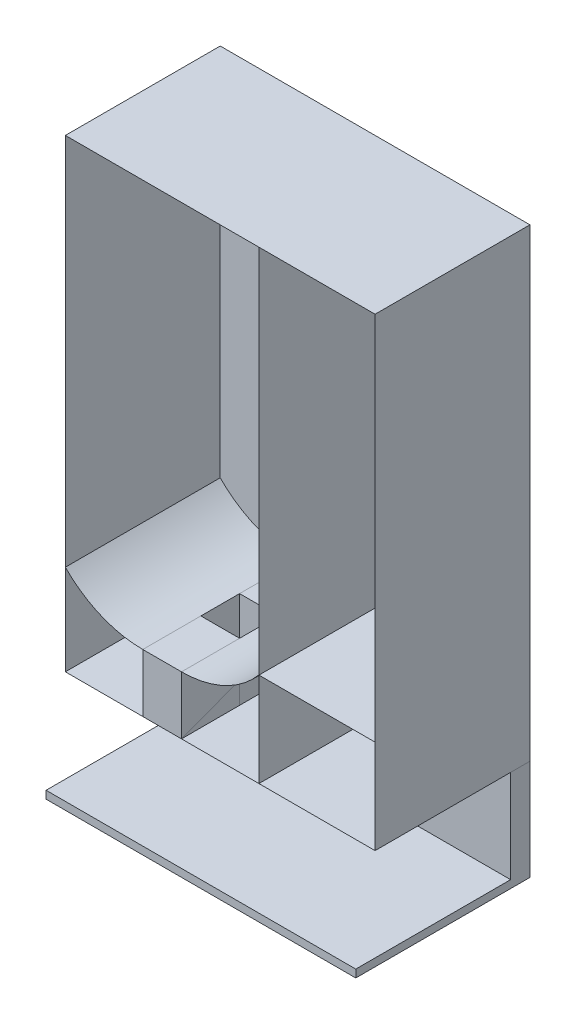
ISO-10303-21;
HEADER;
FILE_DESCRIPTION(('STEP AP214'),'2;1');
FILE_NAME('part.step','',(''),(''),'','','');
FILE_SCHEMA(('AUTOMOTIVE_DESIGN { 1 0 10303 214 1 1 1 1 }'));
ENDSEC;
DATA;
#1=APPLICATION_CONTEXT('core data for automotive mechanical design processes');
#2=APPLICATION_PROTOCOL_DEFINITION('international standard','automotive_design',2000,#1);
#3=PRODUCT_CONTEXT('',#1,'mechanical');
#4=PRODUCT('Part','Part','',(#3));
#5=PRODUCT_RELATED_PRODUCT_CATEGORY('part','',(#4));
#6=PRODUCT_DEFINITION_FORMATION('','',#4);
#7=PRODUCT_DEFINITION_CONTEXT('part definition',#1,'design');
#8=PRODUCT_DEFINITION('design','',#6,#7);
#9=PRODUCT_DEFINITION_SHAPE('','',#8);
#10=(LENGTH_UNIT() NAMED_UNIT(*) SI_UNIT(.MILLI.,.METRE.));
#11=(NAMED_UNIT(*) PLANE_ANGLE_UNIT() SI_UNIT($,.RADIAN.));
#12=(NAMED_UNIT(*) SI_UNIT($,.STERADIAN.) SOLID_ANGLE_UNIT());
#13=UNCERTAINTY_MEASURE_WITH_UNIT(LENGTH_MEASURE(1.E-05),#10,'distance_accuracy_value','');
#14=(GEOMETRIC_REPRESENTATION_CONTEXT(3) GLOBAL_UNCERTAINTY_ASSIGNED_CONTEXT((#13)) GLOBAL_UNIT_ASSIGNED_CONTEXT((#10,
#11,#12)) REPRESENTATION_CONTEXT('',''));
#15=CARTESIAN_POINT('',(0.,0.,0.));
#16=DIRECTION('',(0.,0.,1.));
#17=DIRECTION('',(1.,0.,0.));
#18=AXIS2_PLACEMENT_3D('',#15,#16,#17);
#19=CARTESIAN_POINT('',(49.9253219119787,-178.659775416633,0.));
#20=DIRECTION('',(0.,-1.,0.));
#21=DIRECTION('',(0.,0.,-1.));
#22=AXIS2_PLACEMENT_3D('',#19,#20,#21);
#23=PLANE('',#22);
#24=DIRECTION('',(1.,0.,0.));
#25=VECTOR('',#24,1.);
#26=CARTESIAN_POINT('',(49.9253219119787,-178.659775416633,200.));
#27=LINE('',#26,#25);
#28=CARTESIAN_POINT('',(49.9253219119787,-178.659775416633,200.));
#29=VERTEX_POINT('',#28);
#30=CARTESIAN_POINT('',(200.,-178.659775416633,200.));
#31=VERTEX_POINT('',#30);
#32=EDGE_CURVE('E72',#29,#31,#27,.T.);
#33=ORIENTED_EDGE('',*,*,#32,.F.);
#34=DIRECTION('',(0.,0.,1.));
#35=VECTOR('',#34,1.);
#36=CARTESIAN_POINT('',(49.9253219119787,-178.659775416633,0.));
#37=LINE('',#36,#35);
#38=CARTESIAN_POINT('',(49.9253219119787,-178.659775416633,0.));
#39=VERTEX_POINT('',#38);
#40=EDGE_CURVE('E54',#39,#29,#37,.T.);
#41=ORIENTED_EDGE('',*,*,#40,.F.);
#42=DIRECTION('',(1.,0.,0.));
#43=VECTOR('',#42,1.);
#44=CARTESIAN_POINT('',(49.9253219119787,-178.659775416633,0.));
#45=LINE('',#44,#43);
#46=CARTESIAN_POINT('',(200.,-178.659775416633,0.));
#47=VERTEX_POINT('',#46);
#48=EDGE_CURVE('E60',#39,#47,#45,.T.);
#49=ORIENTED_EDGE('',*,*,#48,.T.);
#50=DIRECTION('',(0.,0.,1.));
#51=VECTOR('',#50,1.);
#52=CARTESIAN_POINT('',(200.,-178.659775416633,0.));
#53=LINE('',#52,#51);
#54=EDGE_CURVE('E12',#47,#31,#53,.T.);
#55=ORIENTED_EDGE('',*,*,#54,.T.);
#56=EDGE_LOOP('',(#33,#41,#49,#55));
#57=FACE_BOUND('',#56,.T.);
#58=ADVANCED_FACE('F53',(#57),#23,.T.);
#59=OPEN_SHELL('',(#58));
#60=SHELL_BASED_SURFACE_MODEL('B2',(#59));
#61=CARTESIAN_POINT('',(-100.,-225.,200.));
#62=DIRECTION('',(1.,0.,0.));
#63=DIRECTION('',(0.,0.,-1.));
#64=AXIS2_PLACEMENT_3D('',#61,#62,#63);
#65=PLANE('',#64);
#66=DIRECTION('',(0.,0.,1.));
#67=VECTOR('',#66,1.);
#68=CARTESIAN_POINT('',(-100.,-300.,200.));
#69=LINE('',#68,#67);
#70=CARTESIAN_POINT('',(-100.,-300.,125.));
#71=VERTEX_POINT('',#70);
#72=CARTESIAN_POINT('',(-100.,-300.,200.));
#73=VERTEX_POINT('',#72);
#74=EDGE_CURVE('E169',#71,#73,#69,.T.);
#75=ORIENTED_EDGE('',*,*,#74,.T.);
#76=DIRECTION('',(0.,-1.,0.));
#77=VECTOR('',#76,1.);
#78=CARTESIAN_POINT('',(-100.,-225.,200.));
#79=LINE('',#78,#77);
#80=CARTESIAN_POINT('',(-100.,-225.,200.));
#81=VERTEX_POINT('',#80);
#82=EDGE_CURVE('E51',#81,#73,#79,.T.);
#83=ORIENTED_EDGE('',*,*,#82,.F.);
#84=DIRECTION('',(0.,0.,1.));
#85=VECTOR('',#84,1.);
#86=CARTESIAN_POINT('',(-100.,-225.,200.));
#87=LINE('',#86,#85);
#88=CARTESIAN_POINT('',(-100.,-225.,125.));
#89=VERTEX_POINT('',#88);
#90=EDGE_CURVE('E157',#89,#81,#87,.T.);
#91=ORIENTED_EDGE('',*,*,#90,.F.);
#92=DIRECTION('',(0.,-1.,0.));
#93=VECTOR('',#92,1.);
#94=CARTESIAN_POINT('',(-100.,-225.,125.));
#95=LINE('',#94,#93);
#96=EDGE_CURVE('E165',#89,#71,#95,.T.);
#97=ORIENTED_EDGE('',*,*,#96,.T.);
#98=EDGE_LOOP('',(#75,#83,#91,#97));
#99=FACE_BOUND('',#98,.T.);
#100=ADVANCED_FACE('F106',(#99),#65,.F.);
#101=CARTESIAN_POINT('',(-50.,-225.,200.));
#102=DIRECTION('',(0.,0.,-1.));
#103=DIRECTION('',(-1.,0.,0.));
#104=AXIS2_PLACEMENT_3D('',#101,#102,#103);
#105=PLANE('',#104);
#106=DIRECTION('',(1.,0.,0.));
#107=VECTOR('',#106,1.);
#108=CARTESIAN_POINT('',(-50.,-300.,200.));
#109=LINE('',#108,#107);
#110=CARTESIAN_POINT('',(-50.,-300.,200.));
#111=VERTEX_POINT('',#110);
#112=EDGE_CURVE('E161',#73,#111,#109,.T.);
#113=ORIENTED_EDGE('',*,*,#112,.T.);
#114=DIRECTION('',(0.,-1.,0.));
#115=VECTOR('',#114,1.);
#116=CARTESIAN_POINT('',(-50.,-225.,200.));
#117=LINE('',#116,#115);
#118=CARTESIAN_POINT('',(-50.,-225.,200.));
#119=VERTEX_POINT('',#118);
#120=EDGE_CURVE('E114',#119,#111,#117,.T.);
#121=ORIENTED_EDGE('',*,*,#120,.F.);
#122=DIRECTION('',(1.,0.,0.));
#123=VECTOR('',#122,1.);
#124=CARTESIAN_POINT('',(-50.,-225.,200.));
#125=LINE('',#124,#123);
#126=EDGE_CURVE('E152',#81,#119,#125,.T.);
#127=ORIENTED_EDGE('',*,*,#126,.F.);
#128=ORIENTED_EDGE('',*,*,#82,.T.);
#129=EDGE_LOOP('',(#113,#121,#127,#128));
#130=FACE_BOUND('',#129,.T.);
#131=ADVANCED_FACE('F160',(#130),#105,.F.);
#132=CARTESIAN_POINT('',(-50.,-225.,125.));
#133=DIRECTION('',(-1.,0.,0.));
#134=DIRECTION('',(0.,0.,1.));
#135=AXIS2_PLACEMENT_3D('',#132,#133,#134);
#136=PLANE('',#135);
#137=DIRECTION('',(0.,0.,-1.));
#138=VECTOR('',#137,1.);
#139=CARTESIAN_POINT('',(-50.,-300.,125.));
#140=LINE('',#139,#138);
#141=CARTESIAN_POINT('',(-50.,-300.,125.));
#142=VERTEX_POINT('',#141);
#143=EDGE_CURVE('E139',#111,#142,#140,.T.);
#144=ORIENTED_EDGE('',*,*,#143,.T.);
#145=DIRECTION('',(0.,-1.,0.));
#146=VECTOR('',#145,1.);
#147=CARTESIAN_POINT('',(-50.,-225.,125.));
#148=LINE('',#147,#146);
#149=CARTESIAN_POINT('',(-50.,-225.,125.));
#150=VERTEX_POINT('',#149);
#151=EDGE_CURVE('E162',#150,#142,#148,.T.);
#152=ORIENTED_EDGE('',*,*,#151,.F.);
#153=DIRECTION('',(0.,0.,-1.));
#154=VECTOR('',#153,1.);
#155=CARTESIAN_POINT('',(-50.,-225.,125.));
#156=LINE('',#155,#154);
#157=EDGE_CURVE('E155',#119,#150,#156,.T.);
#158=ORIENTED_EDGE('',*,*,#157,.F.);
#159=ORIENTED_EDGE('',*,*,#120,.T.);
#160=EDGE_LOOP('',(#144,#152,#158,#159));
#161=FACE_BOUND('',#160,.T.);
#162=ADVANCED_FACE('F163',(#161),#136,.F.);
#163=CARTESIAN_POINT('',(-100.,-225.,125.));
#164=DIRECTION('',(0.,0.,1.));
#165=DIRECTION('',(1.,0.,0.));
#166=AXIS2_PLACEMENT_3D('',#163,#164,#165);
#167=PLANE('',#166);
#168=DIRECTION('',(-1.,0.,0.));
#169=VECTOR('',#168,1.);
#170=CARTESIAN_POINT('',(-100.,-300.,125.));
#171=LINE('',#170,#169);
#172=EDGE_CURVE('E145',#142,#71,#171,.T.);
#173=ORIENTED_EDGE('',*,*,#172,.T.);
#174=ORIENTED_EDGE('',*,*,#96,.F.);
#175=DIRECTION('',(-1.,0.,0.));
#176=VECTOR('',#175,1.);
#177=CARTESIAN_POINT('',(-100.,-225.,125.));
#178=LINE('',#177,#176);
#179=EDGE_CURVE('E122',#150,#89,#178,.T.);
#180=ORIENTED_EDGE('',*,*,#179,.F.);
#181=ORIENTED_EDGE('',*,*,#151,.T.);
#182=EDGE_LOOP('',(#173,#174,#180,#181));
#183=FACE_BOUND('',#182,.T.);
#184=ADVANCED_FACE('F176',(#183),#167,.F.);
#185=CARTESIAN_POINT('',(0.,-225.,0.));
#186=DIRECTION('',(0.,-1.,0.));
#187=DIRECTION('',(0.,0.,-1.));
#188=AXIS2_PLACEMENT_3D('',#185,#186,#187);
#189=PLANE('',#188);
#190=ORIENTED_EDGE('',*,*,#90,.T.);
#191=ORIENTED_EDGE('',*,*,#126,.T.);
#192=ORIENTED_EDGE('',*,*,#157,.T.);
#193=ORIENTED_EDGE('',*,*,#179,.T.);
#194=EDGE_LOOP('',(#190,#191,#192,#193));
#195=FACE_BOUND('',#194,.T.);
#196=ADVANCED_FACE('F153',(#195),#189,.F.);
#197=CARTESIAN_POINT('',(0.,-300.,0.));
#198=DIRECTION('',(0.,-1.,0.));
#199=DIRECTION('',(0.,0.,-1.));
#200=AXIS2_PLACEMENT_3D('',#197,#198,#199);
#201=PLANE('',#200);
#202=ORIENTED_EDGE('',*,*,#74,.F.);
#203=ORIENTED_EDGE('',*,*,#172,.F.);
#204=ORIENTED_EDGE('',*,*,#143,.F.);
#205=ORIENTED_EDGE('',*,*,#112,.F.);
#206=EDGE_LOOP('',(#202,#203,#204,#205));
#207=FACE_BOUND('',#206,.T.);
#208=ADVANCED_FACE('F179',(#207),#201,.T.);
#209=CLOSED_SHELL('',(#100,#131,#162,#184,#196,#208));
#210=MANIFOLD_SOLID_BREP('B6',#209);
#211=CARTESIAN_POINT('',(-50.,-300.,0.));
#212=DIRECTION('',(0.,1.,0.));
#213=DIRECTION('',(0.,0.,1.));
#214=AXIS2_PLACEMENT_3D('',#211,#212,#213);
#215=PLANE('',#214);
#216=DIRECTION('',(-1.,0.,0.));
#217=VECTOR('',#216,1.);
#218=CARTESIAN_POINT('',(-50.,-300.,200.));
#219=LINE('',#218,#217);
#220=CARTESIAN_POINT('',(-50.,-300.,200.));
#221=VERTEX_POINT('',#220);
#222=CARTESIAN_POINT('',(-100.,-300.,200.));
#223=VERTEX_POINT('',#222);
#224=EDGE_CURVE('E288',#221,#223,#219,.T.);
#225=ORIENTED_EDGE('',*,*,#224,.F.);
#226=DIRECTION('',(0.,0.,1.));
#227=VECTOR('',#226,1.);
#228=CARTESIAN_POINT('',(-50.,-300.,0.));
#229=LINE('',#228,#227);
#230=CARTESIAN_POINT('',(-50.,-300.,0.));
#231=VERTEX_POINT('',#230);
#232=EDGE_CURVE('E241',#231,#221,#229,.T.);
#233=ORIENTED_EDGE('',*,*,#232,.F.);
#234=DIRECTION('',(-1.,0.,0.));
#235=VECTOR('',#234,1.);
#236=CARTESIAN_POINT('',(-50.,-300.,0.));
#237=LINE('',#236,#235);
#238=CARTESIAN_POINT('',(-100.,-300.,0.));
#239=VERTEX_POINT('',#238);
#240=EDGE_CURVE('E104',#231,#239,#237,.T.);
#241=ORIENTED_EDGE('',*,*,#240,.T.);
#242=DIRECTION('',(0.,0.,1.));
#243=VECTOR('',#242,1.);
#244=CARTESIAN_POINT('',(-100.,-300.,0.));
#245=LINE('',#244,#243);
#246=EDGE_CURVE('E280',#239,#223,#245,.T.);
#247=ORIENTED_EDGE('',*,*,#246,.T.);
#248=EDGE_LOOP('',(#225,#233,#241,#247));
#249=FACE_BOUND('',#248,.T.);
#250=ADVANCED_FACE('F239',(#249),#215,.T.);
#251=CARTESIAN_POINT('',(-100.,-300.,0.));
#252=DIRECTION('',(1.,0.,0.));
#253=DIRECTION('',(0.,1.,0.));
#254=AXIS2_PLACEMENT_3D('',#251,#252,#253);
#255=PLANE('',#254);
#256=DIRECTION('',(0.,1.,0.));
#257=VECTOR('',#256,1.);
#258=CARTESIAN_POINT('',(-100.,-300.,200.));
#259=LINE('',#258,#257);
#260=CARTESIAN_POINT('',(-100.,-225.,200.));
#261=VERTEX_POINT('',#260);
#262=EDGE_CURVE('E285',#223,#261,#259,.T.);
#263=ORIENTED_EDGE('',*,*,#262,.F.);
#264=ORIENTED_EDGE('',*,*,#246,.F.);
#265=DIRECTION('',(0.,1.,0.));
#266=VECTOR('',#265,1.);
#267=CARTESIAN_POINT('',(-100.,-300.,0.));
#268=LINE('',#267,#266);
#269=CARTESIAN_POINT('',(-100.,-225.,0.));
#270=VERTEX_POINT('',#269);
#271=EDGE_CURVE('E283',#239,#270,#268,.T.);
#272=ORIENTED_EDGE('',*,*,#271,.T.);
#273=DIRECTION('',(0.,0.,1.));
#274=VECTOR('',#273,1.);
#275=CARTESIAN_POINT('',(-100.,-225.,0.));
#276=LINE('',#275,#274);
#277=EDGE_CURVE('E269',#270,#261,#276,.T.);
#278=ORIENTED_EDGE('',*,*,#277,.T.);
#279=EDGE_LOOP('',(#263,#264,#272,#278));
#280=FACE_BOUND('',#279,.T.);
#281=ADVANCED_FACE('F282',(#280),#255,.T.);
#282=CARTESIAN_POINT('',(-100.,-85.0094261131661,0.));
#283=DIRECTION('',(0.,0.,1.));
#284=DIRECTION('',(1.,0.,0.));
#285=AXIS2_PLACEMENT_3D('',#282,#283,#284);
#286=CYLINDRICAL_SURFACE('',#285,139.990573886834);
#287=CARTESIAN_POINT('',(-100.,-85.0094261131661,200.));
#288=DIRECTION('',(0.,0.,-1.));
#289=DIRECTION('',(-1.,0.,0.));
#290=AXIS2_PLACEMENT_3D('',#287,#288,#289);
#291=CIRCLE('',#290,139.990573886834);
#292=CARTESIAN_POINT('',(-200.,-182.975546671067,200.));
#293=VERTEX_POINT('',#292);
#294=EDGE_CURVE('E301',#261,#293,#291,.T.);
#295=ORIENTED_EDGE('',*,*,#294,.F.);
#296=ORIENTED_EDGE('',*,*,#277,.F.);
#297=CARTESIAN_POINT('',(-100.,-85.0094261131661,0.));
#298=DIRECTION('',(0.,0.,-1.));
#299=DIRECTION('',(-1.,0.,0.));
#300=AXIS2_PLACEMENT_3D('',#297,#298,#299);
#301=CIRCLE('',#300,139.990573886834);
#302=CARTESIAN_POINT('',(-200.,-182.975546671067,0.));
#303=VERTEX_POINT('',#302);
#304=EDGE_CURVE('E311',#270,#303,#301,.T.);
#305=ORIENTED_EDGE('',*,*,#304,.T.);
#306=DIRECTION('',(0.,0.,1.));
#307=VECTOR('',#306,1.);
#308=CARTESIAN_POINT('',(-200.,-182.975546671067,0.));
#309=LINE('',#308,#307);
#310=EDGE_CURVE('E252',#303,#293,#309,.T.);
#311=ORIENTED_EDGE('',*,*,#310,.T.);
#312=EDGE_LOOP('',(#295,#296,#305,#311));
#313=FACE_BOUND('',#312,.T.);
#314=ADVANCED_FACE('F294',(#313),#286,.F.);
#315=OPEN_SHELL('',(#250,#281,#314));
#316=SHELL_BASED_SURFACE_MODEL('B45',(#315));
#317=CARTESIAN_POINT('',(-50.,-300.,0.));
#318=DIRECTION('',(1.,0.,0.));
#319=DIRECTION('',(0.,1.,0.));
#320=AXIS2_PLACEMENT_3D('',#317,#318,#319);
#321=PLANE('',#320);
#322=DIRECTION('',(0.,1.,0.));
#323=VECTOR('',#322,1.);
#324=CARTESIAN_POINT('',(-50.,-300.,200.));
#325=LINE('',#324,#323);
#326=CARTESIAN_POINT('',(-50.,-300.,200.));
#327=VERTEX_POINT('',#326);
#328=CARTESIAN_POINT('',(-50.,-225.,200.));
#329=VERTEX_POINT('',#328);
#330=EDGE_CURVE('E389',#327,#329,#325,.T.);
#331=ORIENTED_EDGE('',*,*,#330,.F.);
#332=DIRECTION('',(0.,0.,1.));
#333=VECTOR('',#332,1.);
#334=CARTESIAN_POINT('',(-50.,-300.,0.));
#335=LINE('',#334,#333);
#336=CARTESIAN_POINT('',(-50.,-300.,0.));
#337=VERTEX_POINT('',#336);
#338=EDGE_CURVE('E358',#337,#327,#335,.T.);
#339=ORIENTED_EDGE('',*,*,#338,.F.);
#340=DIRECTION('',(0.,1.,0.));
#341=VECTOR('',#340,1.);
#342=CARTESIAN_POINT('',(-50.,-300.,0.));
#343=LINE('',#342,#341);
#344=CARTESIAN_POINT('',(-50.,-225.,0.));
#345=VERTEX_POINT('',#344);
#346=EDGE_CURVE('E237',#337,#345,#343,.T.);
#347=ORIENTED_EDGE('',*,*,#346,.T.);
#348=DIRECTION('',(0.,0.,1.));
#349=VECTOR('',#348,1.);
#350=CARTESIAN_POINT('',(-50.,-225.,0.));
#351=LINE('',#350,#349);
#352=EDGE_CURVE('E382',#345,#329,#351,.T.);
#353=ORIENTED_EDGE('',*,*,#352,.T.);
#354=EDGE_LOOP('',(#331,#339,#347,#353));
#355=FACE_BOUND('',#354,.T.);
#356=ADVANCED_FACE('F356',(#355),#321,.T.);
#357=CARTESIAN_POINT('',(-50.0000000000001,-94.3315680124971,0.));
#358=DIRECTION('',(0.,0.,1.));
#359=DIRECTION('',(1.,0.,0.));
#360=AXIS2_PLACEMENT_3D('',#357,#358,#359);
#361=CYLINDRICAL_SURFACE('',#360,130.668431987503);
#362=CARTESIAN_POINT('',(-50.0000000000001,-94.3315680124971,200.));
#363=DIRECTION('',(0.,0.,1.));
#364=DIRECTION('',(1.,0.,0.));
#365=AXIS2_PLACEMENT_3D('',#362,#363,#364);
#366=CIRCLE('',#365,130.668431987503);
#367=CARTESIAN_POINT('',(49.9999999999999,-178.440064123607,200.));
#368=VERTEX_POINT('',#367);
#369=EDGE_CURVE('E404',#329,#368,#366,.T.);
#370=ORIENTED_EDGE('',*,*,#369,.F.);
#371=ORIENTED_EDGE('',*,*,#352,.F.);
#372=CARTESIAN_POINT('',(-50.0000000000001,-94.3315680124971,0.));
#373=DIRECTION('',(0.,0.,1.));
#374=DIRECTION('',(1.,0.,0.));
#375=AXIS2_PLACEMENT_3D('',#372,#373,#374);
#376=CIRCLE('',#375,130.668431987503);
#377=CARTESIAN_POINT('',(49.9999999999999,-178.440064123607,0.));
#378=VERTEX_POINT('',#377);
#379=EDGE_CURVE('E400',#345,#378,#376,.T.);
#380=ORIENTED_EDGE('',*,*,#379,.T.);
#381=DIRECTION('',(0.,0.,1.));
#382=VECTOR('',#381,1.);
#383=CARTESIAN_POINT('',(49.9999999999999,-178.440064123607,0.));
#384=LINE('',#383,#382);
#385=EDGE_CURVE('E369',#378,#368,#384,.T.);
#386=ORIENTED_EDGE('',*,*,#385,.T.);
#387=EDGE_LOOP('',(#370,#371,#380,#386));
#388=FACE_BOUND('',#387,.T.);
#389=ADVANCED_FACE('F408',(#388),#361,.T.);
#390=OPEN_SHELL('',(#356,#389));
#391=SHELL_BASED_SURFACE_MODEL('B98',(#390));
#392=CARTESIAN_POINT('',(0.,-300.,0.));
#393=DIRECTION('',(0.,-1.,0.));
#394=DIRECTION('',(0.,0.,-1.));
#395=AXIS2_PLACEMENT_3D('',#392,#393,#394);
#396=PLANE('',#395);
#397=DIRECTION('',(0.,0.,1.));
#398=VECTOR('',#397,1.);
#399=CARTESIAN_POINT('',(-100.,-300.,0.));
#400=LINE('',#399,#398);
#401=CARTESIAN_POINT('',(-100.,-300.,0.));
#402=VERTEX_POINT('',#401);
#403=CARTESIAN_POINT('',(-100.,-300.,24.9261476387135));
#404=VERTEX_POINT('',#403);
#405=EDGE_CURVE('E458',#402,#404,#400,.T.);
#406=ORIENTED_EDGE('',*,*,#405,.F.);
#407=DIRECTION('',(1.,0.,0.));
#408=VECTOR('',#407,1.);
#409=CARTESIAN_POINT('',(-200.,-300.,0.));
#410=LINE('',#409,#408);
#411=CARTESIAN_POINT('',(-200.,-300.,0.));
#412=VERTEX_POINT('',#411);
#413=EDGE_CURVE('E586',#412,#402,#410,.T.);
#414=ORIENTED_EDGE('',*,*,#413,.F.);
#415=DIRECTION('',(0.,0.,-1.));
#416=VECTOR('',#415,1.);
#417=CARTESIAN_POINT('',(-200.,-300.,24.9261476387135));
#418=LINE('',#417,#416);
#419=CARTESIAN_POINT('',(-200.,-300.,24.9261476387135));
#420=VERTEX_POINT('',#419);
#421=EDGE_CURVE('E573',#420,#412,#418,.T.);
#422=ORIENTED_EDGE('',*,*,#421,.F.);
#423=DIRECTION('',(-1.,0.,0.));
#424=VECTOR('',#423,1.);
#425=CARTESIAN_POINT('',(200.,-300.,24.9261476387135));
#426=LINE('',#425,#424);
#427=EDGE_CURVE('E463',#404,#420,#426,.T.);
#428=ORIENTED_EDGE('',*,*,#427,.F.);
#429=EDGE_LOOP('',(#406,#414,#422,#428));
#430=FACE_BOUND('',#429,.T.);
#431=ADVANCED_FACE('F441',(#430),#396,.F.);
#432=DIRECTION('',(0.,0.,-1.));
#433=VECTOR('',#432,1.);
#434=CARTESIAN_POINT('',(-50.,-300.,75.));
#435=LINE('',#434,#433);
#436=CARTESIAN_POINT('',(-50.,-300.,24.9261476387135));
#437=VERTEX_POINT('',#436);
#438=CARTESIAN_POINT('',(-50.,-300.,0.));
#439=VERTEX_POINT('',#438);
#440=EDGE_CURVE('E354',#437,#439,#435,.T.);
#441=ORIENTED_EDGE('',*,*,#440,.F.);
#442=CARTESIAN_POINT('',(200.,-300.,24.9261476387135));
#443=VERTEX_POINT('',#442);
#444=EDGE_CURVE('E578',#443,#437,#426,.T.);
#445=ORIENTED_EDGE('',*,*,#444,.F.);
#446=DIRECTION('',(0.,0.,1.));
#447=VECTOR('',#446,1.);
#448=CARTESIAN_POINT('',(200.,-300.,0.));
#449=LINE('',#448,#447);
#450=CARTESIAN_POINT('',(200.,-300.,0.));
#451=VERTEX_POINT('',#450);
#452=EDGE_CURVE('E588',#451,#443,#449,.T.);
#453=ORIENTED_EDGE('',*,*,#452,.F.);
#454=EDGE_CURVE('E585',#439,#451,#410,.T.);
#455=ORIENTED_EDGE('',*,*,#454,.F.);
#456=EDGE_LOOP('',(#441,#445,#453,#455));
#457=FACE_BOUND('',#456,.T.);
#458=ADVANCED_FACE('F609',(#457),#396,.F.);
#459=CARTESIAN_POINT('',(200.,-430.,24.9261476387135));
#460=DIRECTION('',(0.,0.,-1.));
#461=DIRECTION('',(-1.,0.,0.));
#462=AXIS2_PLACEMENT_3D('',#459,#460,#461);
#463=PLANE('',#462);
#464=DIRECTION('',(-1.,0.,0.));
#465=VECTOR('',#464,1.);
#466=CARTESIAN_POINT('',(-200.,-420.,24.9261476387135));
#467=LINE('',#466,#465);
#468=CARTESIAN_POINT('',(200.,-420.,24.9261476387135));
#469=VERTEX_POINT('',#468);
#470=CARTESIAN_POINT('',(-200.,-420.,24.9261476387135));
#471=VERTEX_POINT('',#470);
#472=EDGE_CURVE('E549',#469,#471,#467,.T.);
#473=ORIENTED_EDGE('',*,*,#472,.F.);
#474=DIRECTION('',(0.,1.,0.));
#475=VECTOR('',#474,1.);
#476=CARTESIAN_POINT('',(200.,-430.,24.9261476387135));
#477=LINE('',#476,#475);
#478=EDGE_CURVE('E596',#469,#443,#477,.T.);
#479=ORIENTED_EDGE('',*,*,#478,.T.);
#480=ORIENTED_EDGE('',*,*,#444,.T.);
#481=EDGE_CURVE('E593',#437,#404,#426,.T.);
#482=ORIENTED_EDGE('',*,*,#481,.T.);
#483=ORIENTED_EDGE('',*,*,#427,.T.);
#484=DIRECTION('',(0.,1.,0.));
#485=VECTOR('',#484,1.);
#486=CARTESIAN_POINT('',(-200.,-430.,24.9261476387135));
#487=LINE('',#486,#485);
#488=EDGE_CURVE('E582',#471,#420,#487,.T.);
#489=ORIENTED_EDGE('',*,*,#488,.F.);
#490=EDGE_LOOP('',(#473,#479,#480,#482,#483,#489));
#491=FACE_BOUND('',#490,.T.);
#492=ADVANCED_FACE('F614',(#491),#463,.F.);
#493=CARTESIAN_POINT('',(-200.,-430.,24.9261476387135));
#494=DIRECTION('',(1.,0.,0.));
#495=DIRECTION('',(0.,0.,-1.));
#496=AXIS2_PLACEMENT_3D('',#493,#494,#495);
#497=PLANE('',#496);
#498=ORIENTED_EDGE('',*,*,#421,.T.);
#499=DIRECTION('',(0.,1.,0.));
#500=VECTOR('',#499,1.);
#501=CARTESIAN_POINT('',(-200.,-430.,0.));
#502=LINE('',#501,#500);
#503=CARTESIAN_POINT('',(-200.,-430.,0.));
#504=VERTEX_POINT('',#503);
#505=EDGE_CURVE('E445',#504,#412,#502,.T.);
#506=ORIENTED_EDGE('',*,*,#505,.F.);
#507=DIRECTION('',(0.,0.,-1.));
#508=VECTOR('',#507,1.);
#509=CARTESIAN_POINT('',(-200.,-430.,24.9261476387135));
#510=LINE('',#509,#508);
#511=CARTESIAN_POINT('',(-200.,-430.,224.926147638714));
#512=VERTEX_POINT('',#511);
#513=EDGE_CURVE('E574',#512,#504,#510,.T.);
#514=ORIENTED_EDGE('',*,*,#513,.F.);
#515=DIRECTION('',(0.,-1.,0.));
#516=VECTOR('',#515,1.);
#517=CARTESIAN_POINT('',(-200.,-430.,224.926147638714));
#518=LINE('',#517,#516);
#519=CARTESIAN_POINT('',(-200.,-420.,224.926147638714));
#520=VERTEX_POINT('',#519);
#521=EDGE_CURVE('E564',#520,#512,#518,.T.);
#522=ORIENTED_EDGE('',*,*,#521,.F.);
#523=DIRECTION('',(0.,0.,-1.));
#524=VECTOR('',#523,1.);
#525=CARTESIAN_POINT('',(-200.,-420.,224.926147638714));
#526=LINE('',#525,#524);
#527=EDGE_CURVE('E566',#520,#471,#526,.T.);
#528=ORIENTED_EDGE('',*,*,#527,.T.);
#529=ORIENTED_EDGE('',*,*,#488,.T.);
#530=EDGE_LOOP('',(#498,#506,#514,#522,#528,#529));
#531=FACE_BOUND('',#530,.T.);
#532=ADVANCED_FACE('F443',(#531),#497,.F.);
#533=CARTESIAN_POINT('',(-200.,-430.,0.));
#534=DIRECTION('',(0.,0.,1.));
#535=DIRECTION('',(1.,0.,0.));
#536=AXIS2_PLACEMENT_3D('',#533,#534,#535);
#537=PLANE('',#536);
#538=ORIENTED_EDGE('',*,*,#413,.T.);
#539=DIRECTION('',(0.,-1.,0.));
#540=VECTOR('',#539,1.);
#541=CARTESIAN_POINT('',(-100.,-225.,0.));
#542=LINE('',#541,#540);
#543=CARTESIAN_POINT('',(-100.,-225.,0.));
#544=VERTEX_POINT('',#543);
#545=EDGE_CURVE('E753',#544,#402,#542,.T.);
#546=ORIENTED_EDGE('',*,*,#545,.F.);
#547=DIRECTION('',(-1.,0.,0.));
#548=VECTOR('',#547,1.);
#549=CARTESIAN_POINT('',(-50.,-225.,0.));
#550=LINE('',#549,#548);
#551=CARTESIAN_POINT('',(-50.,-225.,0.));
#552=VERTEX_POINT('',#551);
#553=EDGE_CURVE('E540',#552,#544,#550,.T.);
#554=ORIENTED_EDGE('',*,*,#553,.F.);
#555=DIRECTION('',(0.,-1.,0.));
#556=VECTOR('',#555,1.);
#557=CARTESIAN_POINT('',(-50.,-225.,0.));
#558=LINE('',#557,#556);
#559=EDGE_CURVE('E554',#552,#439,#558,.T.);
#560=ORIENTED_EDGE('',*,*,#559,.T.);
#561=ORIENTED_EDGE('',*,*,#454,.T.);
#562=DIRECTION('',(0.,1.,0.));
#563=VECTOR('',#562,1.);
#564=CARTESIAN_POINT('',(200.,-430.,0.));
#565=LINE('',#564,#563);
#566=CARTESIAN_POINT('',(200.,-430.,0.));
#567=VERTEX_POINT('',#566);
#568=EDGE_CURVE('E597',#567,#451,#565,.T.);
#569=ORIENTED_EDGE('',*,*,#568,.F.);
#570=DIRECTION('',(1.,0.,0.));
#571=VECTOR('',#570,1.);
#572=CARTESIAN_POINT('',(-200.,-430.,0.));
#573=LINE('',#572,#571);
#574=EDGE_CURVE('E577',#504,#567,#573,.T.);
#575=ORIENTED_EDGE('',*,*,#574,.F.);
#576=ORIENTED_EDGE('',*,*,#505,.T.);
#577=EDGE_LOOP('',(#538,#546,#554,#560,#561,#569,#575,#576));
#578=FACE_BOUND('',#577,.T.);
#579=ADVANCED_FACE('F606',(#578),#537,.F.);
#580=CARTESIAN_POINT('',(200.,-430.,0.));
#581=DIRECTION('',(-1.,0.,0.));
#582=DIRECTION('',(0.,0.,1.));
#583=AXIS2_PLACEMENT_3D('',#580,#581,#582);
#584=PLANE('',#583);
#585=ORIENTED_EDGE('',*,*,#452,.T.);
#586=ORIENTED_EDGE('',*,*,#478,.F.);
#587=DIRECTION('',(0.,0.,-1.));
#588=VECTOR('',#587,1.);
#589=CARTESIAN_POINT('',(200.,-420.,224.926147638714));
#590=LINE('',#589,#588);
#591=CARTESIAN_POINT('',(200.,-420.,224.926147638714));
#592=VERTEX_POINT('',#591);
#593=EDGE_CURVE('E570',#592,#469,#590,.T.);
#594=ORIENTED_EDGE('',*,*,#593,.F.);
#595=DIRECTION('',(0.,1.,0.));
#596=VECTOR('',#595,1.);
#597=CARTESIAN_POINT('',(200.,-420.,224.926147638714));
#598=LINE('',#597,#596);
#599=CARTESIAN_POINT('',(200.,-430.,224.926147638714));
#600=VERTEX_POINT('',#599);
#601=EDGE_CURVE('E560',#600,#592,#598,.T.);
#602=ORIENTED_EDGE('',*,*,#601,.F.);
#603=DIRECTION('',(0.,0.,1.));
#604=VECTOR('',#603,1.);
#605=CARTESIAN_POINT('',(200.,-430.,0.));
#606=LINE('',#605,#604);
#607=EDGE_CURVE('E580',#567,#600,#606,.T.);
#608=ORIENTED_EDGE('',*,*,#607,.F.);
#609=ORIENTED_EDGE('',*,*,#568,.T.);
#610=EDGE_LOOP('',(#585,#586,#594,#602,#608,#609));
#611=FACE_BOUND('',#610,.T.);
#612=ADVANCED_FACE('F623',(#611),#584,.F.);
#613=CARTESIAN_POINT('',(0.,-430.,0.));
#614=DIRECTION('',(0.,-1.,0.));
#615=DIRECTION('',(0.,0.,-1.));
#616=AXIS2_PLACEMENT_3D('',#613,#614,#615);
#617=PLANE('',#616);
#618=ORIENTED_EDGE('',*,*,#513,.T.);
#619=ORIENTED_EDGE('',*,*,#574,.T.);
#620=ORIENTED_EDGE('',*,*,#607,.T.);
#621=DIRECTION('',(1.,0.,0.));
#622=VECTOR('',#621,1.);
#623=CARTESIAN_POINT('',(200.,-430.,224.926147638714));
#624=LINE('',#623,#622);
#625=EDGE_CURVE('E552',#512,#600,#624,.T.);
#626=ORIENTED_EDGE('',*,*,#625,.F.);
#627=EDGE_LOOP('',(#618,#619,#620,#626));
#628=FACE_BOUND('',#627,.T.);
#629=ADVANCED_FACE('F618',(#628),#617,.T.);
#630=CARTESIAN_POINT('',(-200.,-420.,224.926147638714));
#631=DIRECTION('',(0.,-1.,0.));
#632=DIRECTION('',(0.,0.,-1.));
#633=AXIS2_PLACEMENT_3D('',#630,#631,#632);
#634=PLANE('',#633);
#635=ORIENTED_EDGE('',*,*,#472,.T.);
#636=ORIENTED_EDGE('',*,*,#527,.F.);
#637=DIRECTION('',(-1.,0.,0.));
#638=VECTOR('',#637,1.);
#639=CARTESIAN_POINT('',(-200.,-420.,224.926147638714));
#640=LINE('',#639,#638);
#641=EDGE_CURVE('E562',#592,#520,#640,.T.);
#642=ORIENTED_EDGE('',*,*,#641,.F.);
#643=ORIENTED_EDGE('',*,*,#593,.T.);
#644=EDGE_LOOP('',(#635,#636,#642,#643));
#645=FACE_BOUND('',#644,.T.);
#646=ADVANCED_FACE('F655',(#645),#634,.F.);
#647=CARTESIAN_POINT('',(0.,0.,224.926147638714));
#648=DIRECTION('',(0.,0.,-1.));
#649=DIRECTION('',(-1.,0.,0.));
#650=AXIS2_PLACEMENT_3D('',#647,#648,#649);
#651=PLANE('',#650);
#652=ORIENTED_EDGE('',*,*,#625,.T.);
#653=ORIENTED_EDGE('',*,*,#601,.T.);
#654=ORIENTED_EDGE('',*,*,#641,.T.);
#655=ORIENTED_EDGE('',*,*,#521,.T.);
#656=EDGE_LOOP('',(#652,#653,#654,#655));
#657=FACE_BOUND('',#656,.T.);
#658=ADVANCED_FACE('F651',(#657),#651,.F.);
#659=CARTESIAN_POINT('',(-100.,-225.,0.));
#660=DIRECTION('',(1.,0.,0.));
#661=DIRECTION('',(0.,0.,-1.));
#662=AXIS2_PLACEMENT_3D('',#659,#660,#661);
#663=PLANE('',#662);
#664=ORIENTED_EDGE('',*,*,#405,.T.);
#665=CARTESIAN_POINT('',(-100.,-300.,75.));
#666=VERTEX_POINT('',#665);
#667=EDGE_CURVE('E547',#404,#666,#400,.T.);
#668=ORIENTED_EDGE('',*,*,#667,.T.);
#669=DIRECTION('',(0.,-1.,0.));
#670=VECTOR('',#669,1.);
#671=CARTESIAN_POINT('',(-100.,-225.,75.));
#672=LINE('',#671,#670);
#673=CARTESIAN_POINT('',(-100.,-225.,75.));
#674=VERTEX_POINT('',#673);
#675=EDGE_CURVE('E529',#674,#666,#672,.T.);
#676=ORIENTED_EDGE('',*,*,#675,.F.);
#677=DIRECTION('',(0.,0.,1.));
#678=VECTOR('',#677,1.);
#679=CARTESIAN_POINT('',(-100.,-225.,0.));
#680=LINE('',#679,#678);
#681=EDGE_CURVE('E535',#544,#674,#680,.T.);
#682=ORIENTED_EDGE('',*,*,#681,.F.);
#683=ORIENTED_EDGE('',*,*,#545,.T.);
#684=EDGE_LOOP('',(#664,#668,#676,#682,#683));
#685=FACE_BOUND('',#684,.T.);
#686=ADVANCED_FACE('F545',(#685),#663,.F.);
#687=CARTESIAN_POINT('',(-100.,-225.,75.));
#688=DIRECTION('',(0.,0.,-1.));
#689=DIRECTION('',(-1.,0.,0.));
#690=AXIS2_PLACEMENT_3D('',#687,#688,#689);
#691=PLANE('',#690);
#692=DIRECTION('',(1.,0.,0.));
#693=VECTOR('',#692,1.);
#694=CARTESIAN_POINT('',(-100.,-300.,75.));
#695=LINE('',#694,#693);
#696=CARTESIAN_POINT('',(-50.,-300.,75.));
#697=VERTEX_POINT('',#696);
#698=EDGE_CURVE('E749',#666,#697,#695,.T.);
#699=ORIENTED_EDGE('',*,*,#698,.T.);
#700=DIRECTION('',(0.,-1.,0.));
#701=VECTOR('',#700,1.);
#702=CARTESIAN_POINT('',(-50.,-225.,75.));
#703=LINE('',#702,#701);
#704=CARTESIAN_POINT('',(-50.,-225.,75.));
#705=VERTEX_POINT('',#704);
#706=EDGE_CURVE('E531',#705,#697,#703,.T.);
#707=ORIENTED_EDGE('',*,*,#706,.F.);
#708=DIRECTION('',(1.,0.,0.));
#709=VECTOR('',#708,1.);
#710=CARTESIAN_POINT('',(-100.,-225.,75.));
#711=LINE('',#710,#709);
#712=EDGE_CURVE('E525',#674,#705,#711,.T.);
#713=ORIENTED_EDGE('',*,*,#712,.F.);
#714=ORIENTED_EDGE('',*,*,#675,.T.);
#715=EDGE_LOOP('',(#699,#707,#713,#714));
#716=FACE_BOUND('',#715,.T.);
#717=ADVANCED_FACE('F527',(#716),#691,.F.);
#718=CARTESIAN_POINT('',(-50.,-225.,75.));
#719=DIRECTION('',(-1.,0.,0.));
#720=DIRECTION('',(0.,0.,1.));
#721=AXIS2_PLACEMENT_3D('',#718,#719,#720);
#722=PLANE('',#721);
#723=EDGE_CURVE('E451',#697,#437,#435,.T.);
#724=ORIENTED_EDGE('',*,*,#723,.T.);
#725=ORIENTED_EDGE('',*,*,#440,.T.);
#726=ORIENTED_EDGE('',*,*,#559,.F.);
#727=DIRECTION('',(0.,0.,-1.));
#728=VECTOR('',#727,1.);
#729=CARTESIAN_POINT('',(-50.,-225.,75.));
#730=LINE('',#729,#728);
#731=EDGE_CURVE('E534',#705,#552,#730,.T.);
#732=ORIENTED_EDGE('',*,*,#731,.F.);
#733=ORIENTED_EDGE('',*,*,#706,.T.);
#734=EDGE_LOOP('',(#724,#725,#726,#732,#733));
#735=FACE_BOUND('',#734,.T.);
#736=ADVANCED_FACE('F713',(#735),#722,.F.);
#737=CARTESIAN_POINT('',(0.,-225.,0.));
#738=DIRECTION('',(0.,1.,0.));
#739=DIRECTION('',(0.,0.,1.));
#740=AXIS2_PLACEMENT_3D('',#737,#738,#739);
#741=PLANE('',#740);
#742=ORIENTED_EDGE('',*,*,#681,.T.);
#743=ORIENTED_EDGE('',*,*,#712,.T.);
#744=ORIENTED_EDGE('',*,*,#731,.T.);
#745=ORIENTED_EDGE('',*,*,#553,.T.);
#746=EDGE_LOOP('',(#742,#743,#744,#745));
#747=FACE_BOUND('',#746,.T.);
#748=ADVANCED_FACE('F538',(#747),#741,.T.);
#749=CARTESIAN_POINT('',(0.,-300.,0.));
#750=DIRECTION('',(0.,1.,0.));
#751=DIRECTION('',(0.,0.,1.));
#752=AXIS2_PLACEMENT_3D('',#749,#750,#751);
#753=PLANE('',#752);
#754=ORIENTED_EDGE('',*,*,#481,.F.);
#755=ORIENTED_EDGE('',*,*,#723,.F.);
#756=ORIENTED_EDGE('',*,*,#698,.F.);
#757=ORIENTED_EDGE('',*,*,#667,.F.);
#758=EDGE_LOOP('',(#754,#755,#756,#757));
#759=FACE_BOUND('',#758,.T.);
#760=ADVANCED_FACE('F729',(#759),#753,.F.);
#761=CLOSED_SHELL('',(#431,#458,#492,#532,#579,#612,#629,#646,#658,#686,#717,#736,#748,#760));
#762=MANIFOLD_SOLID_BREP('B231',#761);
#763=CARTESIAN_POINT('',(50.0000000000001,300.,0.));
#764=DIRECTION('',(-1.,0.,0.));
#765=DIRECTION('',(0.,-1.,0.));
#766=AXIS2_PLACEMENT_3D('',#763,#764,#765);
#767=PLANE('',#766);
#768=DIRECTION('',(0.,-1.,0.));
#769=VECTOR('',#768,1.);
#770=CARTESIAN_POINT('',(50.0000000000001,300.,200.));
#771=LINE('',#770,#769);
#772=CARTESIAN_POINT('',(50.0000000000001,300.,200.));
#773=VERTEX_POINT('',#772);
#774=CARTESIAN_POINT('',(50.,-300.,200.));
#775=VERTEX_POINT('',#774);
#776=EDGE_CURVE('E795',#773,#775,#771,.T.);
#777=ORIENTED_EDGE('',*,*,#776,.F.);
#778=DIRECTION('',(0.,0.,1.));
#779=VECTOR('',#778,1.);
#780=CARTESIAN_POINT('',(50.0000000000001,300.,0.));
#781=LINE('',#780,#779);
#782=CARTESIAN_POINT('',(50.0000000000001,300.,0.));
#783=VERTEX_POINT('',#782);
#784=EDGE_CURVE('E777',#783,#773,#781,.T.);
#785=ORIENTED_EDGE('',*,*,#784,.F.);
#786=DIRECTION('',(0.,-1.,0.));
#787=VECTOR('',#786,1.);
#788=CARTESIAN_POINT('',(50.0000000000001,300.,0.));
#789=LINE('',#788,#787);
#790=CARTESIAN_POINT('',(50.,-300.,0.));
#791=VERTEX_POINT('',#790);
#792=EDGE_CURVE('E783',#783,#791,#789,.T.);
#793=ORIENTED_EDGE('',*,*,#792,.T.);
#794=DIRECTION('',(0.,0.,1.));
#795=VECTOR('',#794,1.);
#796=CARTESIAN_POINT('',(50.,-300.,0.));
#797=LINE('',#796,#795);
#798=EDGE_CURVE('E439',#791,#775,#797,.T.);
#799=ORIENTED_EDGE('',*,*,#798,.T.);
#800=EDGE_LOOP('',(#777,#785,#793,#799));
#801=FACE_BOUND('',#800,.T.);
#802=ADVANCED_FACE('F776',(#801),#767,.T.);
#803=OPEN_SHELL('',(#802));
#804=SHELL_BASED_SURFACE_MODEL('B348',(#803));
#805=CARTESIAN_POINT('',(200.,300.,0.));
#806=DIRECTION('',(0.,0.,-1.));
#807=DIRECTION('',(-1.,0.,0.));
#808=AXIS2_PLACEMENT_3D('',#805,#806,#807);
#809=PLANE('',#808);
#810=DIRECTION('',(0.,-1.,0.));
#811=VECTOR('',#810,1.);
#812=CARTESIAN_POINT('',(-200.,300.,0.));
#813=LINE('',#812,#811);
#814=CARTESIAN_POINT('',(-200.,300.,0.));
#815=VERTEX_POINT('',#814);
#816=CARTESIAN_POINT('',(-200.,-300.,0.));
#817=VERTEX_POINT('',#816);
#818=EDGE_CURVE('E847',#815,#817,#813,.T.);
#819=ORIENTED_EDGE('',*,*,#818,.F.);
#820=DIRECTION('',(-1.,0.,0.));
#821=VECTOR('',#820,1.);
#822=CARTESIAN_POINT('',(200.,300.,0.));
#823=LINE('',#822,#821);
#824=CARTESIAN_POINT('',(200.,300.,0.));
#825=VERTEX_POINT('',#824);
#826=EDGE_CURVE('E829',#825,#815,#823,.T.);
#827=ORIENTED_EDGE('',*,*,#826,.F.);
#828=DIRECTION('',(0.,-1.,0.));
#829=VECTOR('',#828,1.);
#830=CARTESIAN_POINT('',(200.,300.,0.));
#831=LINE('',#830,#829);
#832=CARTESIAN_POINT('',(200.,-300.,0.));
#833=VERTEX_POINT('',#832);
#834=EDGE_CURVE('E835',#825,#833,#831,.T.);
#835=ORIENTED_EDGE('',*,*,#834,.T.);
#836=DIRECTION('',(-1.,0.,0.));
#837=VECTOR('',#836,1.);
#838=CARTESIAN_POINT('',(200.,-300.,0.));
#839=LINE('',#838,#837);
#840=EDGE_CURVE('E774',#833,#817,#839,.T.);
#841=ORIENTED_EDGE('',*,*,#840,.T.);
#842=EDGE_LOOP('',(#819,#827,#835,#841));
#843=FACE_BOUND('',#842,.T.);
#844=ADVANCED_FACE('F828',(#843),#809,.T.);
#845=OPEN_SHELL('',(#844));
#846=SHELL_BASED_SURFACE_MODEL('B433',(#845));
#847=CARTESIAN_POINT('',(200.,-300.,0.));
#848=DIRECTION('',(1.,0.,0.));
#849=DIRECTION('',(0.,0.,-1.));
#850=AXIS2_PLACEMENT_3D('',#847,#848,#849);
#851=PLANE('',#850);
#852=DIRECTION('',(0.,1.,0.));
#853=VECTOR('',#852,1.);
#854=CARTESIAN_POINT('',(200.,-300.,200.));
#855=LINE('',#854,#853);
#856=CARTESIAN_POINT('',(200.,-300.,200.));
#857=VERTEX_POINT('',#856);
#858=CARTESIAN_POINT('',(200.,300.,200.));
#859=VERTEX_POINT('',#858);
#860=EDGE_CURVE('E879',#857,#859,#855,.T.);
#861=ORIENTED_EDGE('',*,*,#860,.F.);
#862=DIRECTION('',(0.,0.,1.));
#863=VECTOR('',#862,1.);
#864=CARTESIAN_POINT('',(200.,-300.,0.));
#865=LINE('',#864,#863);
#866=CARTESIAN_POINT('',(200.,-300.,0.));
#867=VERTEX_POINT('',#866);
#868=EDGE_CURVE('E887',#867,#857,#865,.T.);
#869=ORIENTED_EDGE('',*,*,#868,.F.);
#870=DIRECTION('',(0.,1.,0.));
#871=VECTOR('',#870,1.);
#872=CARTESIAN_POINT('',(200.,-300.,0.));
#873=LINE('',#872,#871);
#874=CARTESIAN_POINT('',(200.,300.,0.));
#875=VERTEX_POINT('',#874);
#876=EDGE_CURVE('E826',#867,#875,#873,.T.);
#877=ORIENTED_EDGE('',*,*,#876,.T.);
#878=DIRECTION('',(0.,0.,1.));
#879=VECTOR('',#878,1.);
#880=CARTESIAN_POINT('',(200.,300.,0.));
#881=LINE('',#880,#879);
#882=EDGE_CURVE('E916',#875,#859,#881,.T.);
#883=ORIENTED_EDGE('',*,*,#882,.T.);
#884=EDGE_LOOP('',(#861,#869,#877,#883));
#885=FACE_BOUND('',#884,.T.);
#886=ADVANCED_FACE('F871',(#885),#851,.T.);
#887=CARTESIAN_POINT('',(-200.,300.,0.));
#888=DIRECTION('',(0.,1.,0.));
#889=DIRECTION('',(0.,0.,1.));
#890=AXIS2_PLACEMENT_3D('',#887,#888,#889);
#891=PLANE('',#890);
#892=DIRECTION('',(-1.,0.,0.));
#893=VECTOR('',#892,1.);
#894=CARTESIAN_POINT('',(-200.,300.,200.));
#895=LINE('',#894,#893);
#896=CARTESIAN_POINT('',(-200.,300.,200.));
#897=VERTEX_POINT('',#896);
#898=EDGE_CURVE('E921',#859,#897,#895,.T.);
#899=ORIENTED_EDGE('',*,*,#898,.F.);
#900=ORIENTED_EDGE('',*,*,#882,.F.);
#901=DIRECTION('',(-1.,0.,0.));
#902=VECTOR('',#901,1.);
#903=CARTESIAN_POINT('',(-200.,300.,0.));
#904=LINE('',#903,#902);
#905=CARTESIAN_POINT('',(-200.,300.,0.));
#906=VERTEX_POINT('',#905);
#907=EDGE_CURVE('E919',#875,#906,#904,.T.);
#908=ORIENTED_EDGE('',*,*,#907,.T.);
#909=DIRECTION('',(0.,0.,1.));
#910=VECTOR('',#909,1.);
#911=CARTESIAN_POINT('',(-200.,300.,0.));
#912=LINE('',#911,#910);
#913=EDGE_CURVE('E873',#906,#897,#912,.T.);
#914=ORIENTED_EDGE('',*,*,#913,.T.);
#915=EDGE_LOOP('',(#899,#900,#908,#914));
#916=FACE_BOUND('',#915,.T.);
#917=ADVANCED_FACE('F918',(#916),#891,.T.);
#918=CARTESIAN_POINT('',(-200.,-300.,0.));
#919=DIRECTION('',(-1.,0.,0.));
#920=DIRECTION('',(0.,0.,1.));
#921=AXIS2_PLACEMENT_3D('',#918,#919,#920);
#922=PLANE('',#921);
#923=DIRECTION('',(0.,-1.,0.));
#924=VECTOR('',#923,1.);
#925=CARTESIAN_POINT('',(-200.,-300.,200.));
#926=LINE('',#925,#924);
#927=CARTESIAN_POINT('',(-200.,-300.,200.));
#928=VERTEX_POINT('',#927);
#929=EDGE_CURVE('E945',#897,#928,#926,.T.);
#930=ORIENTED_EDGE('',*,*,#929,.F.);
#931=ORIENTED_EDGE('',*,*,#913,.F.);
#932=DIRECTION('',(0.,-1.,0.));
#933=VECTOR('',#932,1.);
#934=CARTESIAN_POINT('',(-200.,-300.,0.));
#935=LINE('',#934,#933);
#936=CARTESIAN_POINT('',(-200.,-300.,0.));
#937=VERTEX_POINT('',#936);
#938=EDGE_CURVE('E952',#906,#937,#935,.T.);
#939=ORIENTED_EDGE('',*,*,#938,.T.);
#940=DIRECTION('',(0.,0.,1.));
#941=VECTOR('',#940,1.);
#942=CARTESIAN_POINT('',(-200.,-300.,0.));
#943=LINE('',#942,#941);
#944=EDGE_CURVE('E904',#937,#928,#943,.T.);
#945=ORIENTED_EDGE('',*,*,#944,.T.);
#946=EDGE_LOOP('',(#930,#931,#939,#945));
#947=FACE_BOUND('',#946,.T.);
#948=ADVANCED_FACE('F930',(#947),#922,.T.);
#949=CARTESIAN_POINT('',(-200.,-300.,0.));
#950=DIRECTION('',(0.,-1.,0.));
#951=DIRECTION('',(0.,0.,-1.));
#952=AXIS2_PLACEMENT_3D('',#949,#950,#951);
#953=PLANE('',#952);
#954=DIRECTION('',(1.,0.,0.));
#955=VECTOR('',#954,1.);
#956=CARTESIAN_POINT('',(-200.,-300.,200.));
#957=LINE('',#956,#955);
#958=EDGE_CURVE('E940',#928,#857,#957,.T.);
#959=ORIENTED_EDGE('',*,*,#958,.F.);
#960=ORIENTED_EDGE('',*,*,#944,.F.);
#961=DIRECTION('',(1.,0.,0.));
#962=VECTOR('',#961,1.);
#963=CARTESIAN_POINT('',(-200.,-300.,0.));
#964=LINE('',#963,#962);
#965=EDGE_CURVE('E953',#937,#867,#964,.T.);
#966=ORIENTED_EDGE('',*,*,#965,.T.);
#967=ORIENTED_EDGE('',*,*,#868,.T.);
#968=EDGE_LOOP('',(#959,#960,#966,#967));
#969=FACE_BOUND('',#968,.T.);
#970=ADVANCED_FACE('F934',(#969),#953,.T.);
#971=OPEN_SHELL('',(#886,#917,#948,#970));
#972=SHELL_BASED_SURFACE_MODEL('B768',(#971));
#973=ADVANCED_BREP_SHAPE_REPRESENTATION('',(#18,#210,#762),#14);
#974=MANIFOLD_SURFACE_SHAPE_REPRESENTATION('',(#18,#60,#316,#391,#804,#846,#972),#14);
#975=SHAPE_REPRESENTATION('',(#18),#14);
#976=SHAPE_DEFINITION_REPRESENTATION(#9,#975);
#977=SHAPE_REPRESENTATION_RELATIONSHIP('','',#975,#973);
#978=SHAPE_REPRESENTATION_RELATIONSHIP('','',#975,#974);
ENDSEC;
END-ISO-10303-21;
